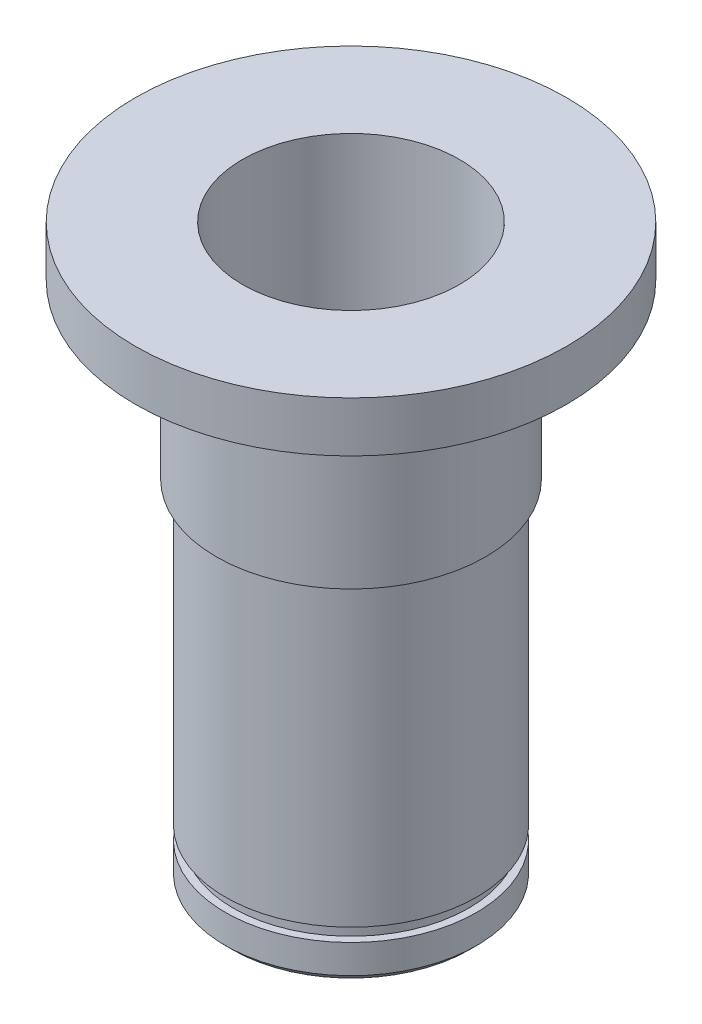
ISO-10303-21;
HEADER;
FILE_DESCRIPTION(('STEP AP214'),'2;1');
FILE_NAME('part.step','',(''),(''),'','','');
FILE_SCHEMA(('AUTOMOTIVE_DESIGN { 1 0 10303 214 1 1 1 1 }'));
ENDSEC;
DATA;
#1=APPLICATION_CONTEXT('core data for automotive mechanical design processes');
#2=APPLICATION_PROTOCOL_DEFINITION('international standard','automotive_design',2000,#1);
#3=PRODUCT_CONTEXT('',#1,'mechanical');
#4=PRODUCT('Part','Part','',(#3));
#5=PRODUCT_RELATED_PRODUCT_CATEGORY('part','',(#4));
#6=PRODUCT_DEFINITION_FORMATION('','',#4);
#7=PRODUCT_DEFINITION_CONTEXT('part definition',#1,'design');
#8=PRODUCT_DEFINITION('design','',#6,#7);
#9=PRODUCT_DEFINITION_SHAPE('','',#8);
#10=(LENGTH_UNIT() NAMED_UNIT(*) SI_UNIT(.MILLI.,.METRE.));
#11=(NAMED_UNIT(*) PLANE_ANGLE_UNIT() SI_UNIT($,.RADIAN.));
#12=(NAMED_UNIT(*) SI_UNIT($,.STERADIAN.) SOLID_ANGLE_UNIT());
#13=UNCERTAINTY_MEASURE_WITH_UNIT(LENGTH_MEASURE(1.E-05),#10,'distance_accuracy_value','');
#14=(GEOMETRIC_REPRESENTATION_CONTEXT(3) GLOBAL_UNCERTAINTY_ASSIGNED_CONTEXT((#13)) GLOBAL_UNIT_ASSIGNED_CONTEXT((#10,
#11,#12)) REPRESENTATION_CONTEXT('',''));
#15=CARTESIAN_POINT('',(0.,0.,0.));
#16=DIRECTION('',(0.,0.,1.));
#17=DIRECTION('',(1.,0.,0.));
#18=AXIS2_PLACEMENT_3D('',#15,#16,#17);
#19=CARTESIAN_POINT('',(0.,18.2827823293179,0.));
#20=DIRECTION('',(0.,1.,0.));
#21=DIRECTION('',(0.,0.,1.));
#22=AXIS2_PLACEMENT_3D('',#19,#20,#21);
#23=CYLINDRICAL_SURFACE('',#22,11.0998);
#24=CARTESIAN_POINT('',(0.,30.400625,0.));
#25=DIRECTION('',(0.,-1.,0.));
#26=DIRECTION('',(0.,0.,-1.));
#27=AXIS2_PLACEMENT_3D('',#24,#25,#26);
#28=CIRCLE('',#27,11.0998);
#29=CARTESIAN_POINT('',(0.,30.400625,-11.0998));
#30=VERTEX_POINT('',#29);
#31=EDGE_CURVE('E55',#30,#30,#28,.T.);
#32=ORIENTED_EDGE('',*,*,#31,.T.);
#33=EDGE_LOOP('',(#32));
#34=FACE_BOUND('',#33,.T.);
#35=CARTESIAN_POINT('',(0.,4.3434,0.));
#36=DIRECTION('',(0.,-1.,0.));
#37=DIRECTION('',(0.,0.,-1.));
#38=AXIS2_PLACEMENT_3D('',#35,#36,#37);
#39=CIRCLE('',#38,11.0998);
#40=CARTESIAN_POINT('',(0.,4.3434,-11.0998));
#41=VERTEX_POINT('',#40);
#42=EDGE_CURVE('E85',#41,#41,#39,.T.);
#43=ORIENTED_EDGE('',*,*,#42,.F.);
#44=EDGE_LOOP('',(#43));
#45=FACE_BOUND('',#44,.T.);
#46=ADVANCED_FACE('F44',(#34,#45),#23,.T.);
#47=CARTESIAN_POINT('',(0.,0.634999999999997,0.));
#48=DIRECTION('',(0.,-1.,0.));
#49=DIRECTION('',(0.,0.,-1.));
#50=AXIS2_PLACEMENT_3D('',#47,#48,#49);
#51=CIRCLE('',#50,11.0998);
#52=CARTESIAN_POINT('',(0.,0.634999999999997,-11.0998));
#53=VERTEX_POINT('',#52);
#54=EDGE_CURVE('E67',#53,#53,#51,.F.);
#55=ORIENTED_EDGE('',*,*,#54,.T.);
#56=EDGE_LOOP('',(#55));
#57=FACE_BOUND('',#56,.T.);
#58=CARTESIAN_POINT('',(0.,3.175,0.));
#59=DIRECTION('',(0.,-1.,0.));
#60=DIRECTION('',(0.,0.,-1.));
#61=AXIS2_PLACEMENT_3D('',#58,#59,#60);
#62=CIRCLE('',#61,11.0998);
#63=CARTESIAN_POINT('',(0.,3.175,-11.0998));
#64=VERTEX_POINT('',#63);
#65=EDGE_CURVE('E94',#64,#64,#62,.T.);
#66=ORIENTED_EDGE('',*,*,#65,.T.);
#67=EDGE_LOOP('',(#66));
#68=FACE_BOUND('',#67,.T.);
#69=ADVANCED_FACE('F98',(#57,#68),#23,.T.);
#70=CARTESIAN_POINT('',(0.,18.2827823293179,0.));
#71=DIRECTION('',(0.,1.,0.));
#72=DIRECTION('',(0.,0.,1.));
#73=AXIS2_PLACEMENT_3D('',#70,#71,#72);
#74=CYLINDRICAL_SURFACE('',#73,11.8999);
#75=CARTESIAN_POINT('',(0.,45.640625,0.));
#76=DIRECTION('',(0.,-1.,0.));
#77=DIRECTION('',(0.,0.,-1.));
#78=AXIS2_PLACEMENT_3D('',#75,#76,#77);
#79=CIRCLE('',#78,11.8999);
#80=CARTESIAN_POINT('',(0.,45.640625,-11.8999));
#81=VERTEX_POINT('',#80);
#82=EDGE_CURVE('E12',#81,#81,#79,.T.);
#83=ORIENTED_EDGE('',*,*,#82,.T.);
#84=EDGE_LOOP('',(#83));
#85=FACE_BOUND('',#84,.T.);
#86=CARTESIAN_POINT('',(0.,30.7975,0.));
#87=DIRECTION('',(0.,1.,0.));
#88=DIRECTION('',(0.,0.,1.));
#89=AXIS2_PLACEMENT_3D('',#86,#87,#88);
#90=CIRCLE('',#89,11.8999);
#91=CARTESIAN_POINT('',(0.,30.7975,11.8999));
#92=VERTEX_POINT('',#91);
#93=EDGE_CURVE('E70',#92,#92,#90,.T.);
#94=ORIENTED_EDGE('',*,*,#93,.T.);
#95=EDGE_LOOP('',(#94));
#96=FACE_BOUND('',#95,.T.);
#97=ADVANCED_FACE('F120',(#85,#96),#74,.T.);
#98=CARTESIAN_POINT('',(-11.8999,30.7975,0.));
#99=DIRECTION('',(0.,-1.,0.));
#100=DIRECTION('',(0.,0.,-1.));
#101=AXIS2_PLACEMENT_3D('',#98,#99,#100);
#102=PLANE('',#101);
#103=CARTESIAN_POINT('',(0.,30.7975,0.));
#104=DIRECTION('',(0.,-1.,0.));
#105=DIRECTION('',(0.,0.,-1.));
#106=AXIS2_PLACEMENT_3D('',#103,#104,#105);
#107=CIRCLE('',#106,11.496675);
#108=CARTESIAN_POINT('',(0.,30.7975,-11.496675));
#109=VERTEX_POINT('',#108);
#110=EDGE_CURVE('E59',#109,#109,#107,.F.);
#111=ORIENTED_EDGE('',*,*,#110,.T.);
#112=EDGE_LOOP('',(#111));
#113=FACE_BOUND('',#112,.T.);
#114=ORIENTED_EDGE('',*,*,#93,.F.);
#115=EDGE_LOOP('',(#114));
#116=FACE_BOUND('',#115,.T.);
#117=ADVANCED_FACE('F127',(#113,#116),#102,.T.);
#118=CARTESIAN_POINT('',(-11.0998,0.,0.));
#119=DIRECTION('',(0.,-1.,0.));
#120=DIRECTION('',(0.,0.,-1.));
#121=AXIS2_PLACEMENT_3D('',#118,#119,#120);
#122=PLANE('',#121);
#123=CARTESIAN_POINT('',(0.,0.,0.));
#124=DIRECTION('',(0.,-1.,0.));
#125=DIRECTION('',(0.,0.,-1.));
#126=AXIS2_PLACEMENT_3D('',#123,#124,#125);
#127=CIRCLE('',#126,10.4648);
#128=CARTESIAN_POINT('',(0.,0.,-10.4648));
#129=VERTEX_POINT('',#128);
#130=EDGE_CURVE('E64',#129,#129,#127,.T.);
#131=ORIENTED_EDGE('',*,*,#130,.T.);
#132=EDGE_LOOP('',(#131));
#133=FACE_BOUND('',#132,.T.);
#134=CARTESIAN_POINT('',(0.,0.,0.));
#135=DIRECTION('',(0.,1.,0.));
#136=DIRECTION('',(0.,0.,1.));
#137=AXIS2_PLACEMENT_3D('',#134,#135,#136);
#138=CIRCLE('',#137,9.5885);
#139=CARTESIAN_POINT('',(0.,0.,9.5885));
#140=VERTEX_POINT('',#139);
#141=EDGE_CURVE('E73',#140,#140,#138,.T.);
#142=ORIENTED_EDGE('',*,*,#141,.T.);
#143=EDGE_LOOP('',(#142));
#144=FACE_BOUND('',#143,.T.);
#145=ADVANCED_FACE('F125',(#133,#144),#122,.T.);
#146=CARTESIAN_POINT('',(0.,18.2827823293179,0.));
#147=DIRECTION('',(0.,1.,0.));
#148=DIRECTION('',(0.,0.,1.));
#149=AXIS2_PLACEMENT_3D('',#146,#147,#148);
#150=CYLINDRICAL_SURFACE('',#149,9.5885);
#151=CARTESIAN_POINT('',(0.,50.4825,0.));
#152=DIRECTION('',(0.,1.,0.));
#153=DIRECTION('',(0.,0.,1.));
#154=AXIS2_PLACEMENT_3D('',#151,#152,#153);
#155=CIRCLE('',#154,9.5885);
#156=CARTESIAN_POINT('',(0.,50.4825,9.5885));
#157=VERTEX_POINT('',#156);
#158=EDGE_CURVE('E76',#157,#157,#155,.T.);
#159=ORIENTED_EDGE('',*,*,#158,.T.);
#160=EDGE_LOOP('',(#159));
#161=FACE_BOUND('',#160,.T.);
#162=ORIENTED_EDGE('',*,*,#141,.F.);
#163=EDGE_LOOP('',(#162));
#164=FACE_BOUND('',#163,.T.);
#165=ADVANCED_FACE('F151',(#161,#164),#150,.F.);
#166=CARTESIAN_POINT('',(-9.5885,50.4825,0.));
#167=DIRECTION('',(0.,1.,0.));
#168=DIRECTION('',(0.,0.,1.));
#169=AXIS2_PLACEMENT_3D('',#166,#167,#168);
#170=PLANE('',#169);
#171=CARTESIAN_POINT('',(0.,50.4825,0.));
#172=DIRECTION('',(0.,1.,0.));
#173=DIRECTION('',(0.,0.,1.));
#174=AXIS2_PLACEMENT_3D('',#171,#172,#173);
#175=CIRCLE('',#174,19.05);
#176=CARTESIAN_POINT('',(0.,50.4825,19.05));
#177=VERTEX_POINT('',#176);
#178=EDGE_CURVE('E79',#177,#177,#175,.T.);
#179=ORIENTED_EDGE('',*,*,#178,.T.);
#180=EDGE_LOOP('',(#179));
#181=FACE_BOUND('',#180,.T.);
#182=ORIENTED_EDGE('',*,*,#158,.F.);
#183=EDGE_LOOP('',(#182));
#184=FACE_BOUND('',#183,.T.);
#185=ADVANCED_FACE('F155',(#181,#184),#170,.T.);
#186=CARTESIAN_POINT('',(0.,18.2827823293179,0.));
#187=DIRECTION('',(0.,1.,0.));
#188=DIRECTION('',(0.,0.,1.));
#189=AXIS2_PLACEMENT_3D('',#186,#187,#188);
#190=CYLINDRICAL_SURFACE('',#189,19.05);
#191=CARTESIAN_POINT('',(0.,46.0375,0.));
#192=DIRECTION('',(0.,1.,0.));
#193=DIRECTION('',(0.,0.,1.));
#194=AXIS2_PLACEMENT_3D('',#191,#192,#193);
#195=CIRCLE('',#194,19.05);
#196=CARTESIAN_POINT('',(0.,46.0375,19.05));
#197=VERTEX_POINT('',#196);
#198=EDGE_CURVE('E82',#197,#197,#195,.T.);
#199=ORIENTED_EDGE('',*,*,#198,.T.);
#200=EDGE_LOOP('',(#199));
#201=FACE_BOUND('',#200,.T.);
#202=ORIENTED_EDGE('',*,*,#178,.F.);
#203=EDGE_LOOP('',(#202));
#204=FACE_BOUND('',#203,.T.);
#205=ADVANCED_FACE('F143',(#201,#204),#190,.T.);
#206=CARTESIAN_POINT('',(-19.05,46.0375,0.));
#207=DIRECTION('',(0.,-1.,0.));
#208=DIRECTION('',(0.,0.,-1.));
#209=AXIS2_PLACEMENT_3D('',#206,#207,#208);
#210=PLANE('',#209);
#211=CARTESIAN_POINT('',(0.,46.0375,0.));
#212=DIRECTION('',(0.,-1.,0.));
#213=DIRECTION('',(0.,0.,-1.));
#214=AXIS2_PLACEMENT_3D('',#211,#212,#213);
#215=CIRCLE('',#214,12.296775);
#216=CARTESIAN_POINT('',(0.,46.0375,-12.296775));
#217=VERTEX_POINT('',#216);
#218=EDGE_CURVE('E51',#217,#217,#215,.F.);
#219=ORIENTED_EDGE('',*,*,#218,.T.);
#220=EDGE_LOOP('',(#219));
#221=FACE_BOUND('',#220,.T.);
#222=ORIENTED_EDGE('',*,*,#198,.F.);
#223=EDGE_LOOP('',(#222));
#224=FACE_BOUND('',#223,.T.);
#225=ADVANCED_FACE('F135',(#221,#224),#210,.T.);
#226=CARTESIAN_POINT('',(0.,0.634999999999997,0.));
#227=DIRECTION('',(0.,1.,0.));
#228=DIRECTION('',(0.,0.,1.));
#229=AXIS2_PLACEMENT_3D('',#226,#227,#228);
#230=CONICAL_SURFACE('',#229,11.0998,0.785398163397452);
#231=ORIENTED_EDGE('',*,*,#130,.F.);
#232=EDGE_LOOP('',(#231));
#233=FACE_BOUND('',#232,.T.);
#234=ORIENTED_EDGE('',*,*,#54,.F.);
#235=EDGE_LOOP('',(#234));
#236=FACE_BOUND('',#235,.T.);
#237=ADVANCED_FACE('F133',(#233,#236),#230,.T.);
#238=CARTESIAN_POINT('',(-11.0998,4.3434,0.));
#239=DIRECTION('',(0.,-1.,0.));
#240=DIRECTION('',(0.,0.,-1.));
#241=AXIS2_PLACEMENT_3D('',#238,#239,#240);
#242=PLANE('',#241);
#243=ORIENTED_EDGE('',*,*,#42,.T.);
#244=EDGE_LOOP('',(#243));
#245=FACE_BOUND('',#244,.T.);
#246=CARTESIAN_POINT('',(0.,4.3434,0.));
#247=DIRECTION('',(0.,-1.,0.));
#248=DIRECTION('',(0.,0.,-1.));
#249=AXIS2_PLACEMENT_3D('',#246,#247,#248);
#250=CIRCLE('',#249,10.4267);
#251=CARTESIAN_POINT('',(0.,4.3434,-10.4267));
#252=VERTEX_POINT('',#251);
#253=EDGE_CURVE('E88',#252,#252,#250,.T.);
#254=ORIENTED_EDGE('',*,*,#253,.F.);
#255=EDGE_LOOP('',(#254));
#256=FACE_BOUND('',#255,.T.);
#257=ADVANCED_FACE('F111',(#245,#256),#242,.T.);
#258=CARTESIAN_POINT('',(0.,-2.07005721397897,0.));
#259=DIRECTION('',(0.,-1.,0.));
#260=DIRECTION('',(0.,0.,-1.));
#261=AXIS2_PLACEMENT_3D('',#258,#259,#260);
#262=CYLINDRICAL_SURFACE('',#261,10.4267);
#263=ORIENTED_EDGE('',*,*,#253,.T.);
#264=EDGE_LOOP('',(#263));
#265=FACE_BOUND('',#264,.T.);
#266=CARTESIAN_POINT('',(0.,3.175,0.));
#267=DIRECTION('',(0.,-1.,0.));
#268=DIRECTION('',(0.,0.,-1.));
#269=AXIS2_PLACEMENT_3D('',#266,#267,#268);
#270=CIRCLE('',#269,10.4267);
#271=CARTESIAN_POINT('',(0.,3.175,-10.4267));
#272=VERTEX_POINT('',#271);
#273=EDGE_CURVE('E91',#272,#272,#270,.T.);
#274=ORIENTED_EDGE('',*,*,#273,.F.);
#275=EDGE_LOOP('',(#274));
#276=FACE_BOUND('',#275,.T.);
#277=ADVANCED_FACE('F103',(#265,#276),#262,.T.);
#278=CARTESIAN_POINT('',(-11.0998,3.175,0.));
#279=DIRECTION('',(0.,1.,0.));
#280=DIRECTION('',(0.,0.,1.));
#281=AXIS2_PLACEMENT_3D('',#278,#279,#280);
#282=PLANE('',#281);
#283=ORIENTED_EDGE('',*,*,#273,.T.);
#284=EDGE_LOOP('',(#283));
#285=FACE_BOUND('',#284,.T.);
#286=ORIENTED_EDGE('',*,*,#65,.F.);
#287=EDGE_LOOP('',(#286));
#288=FACE_BOUND('',#287,.T.);
#289=ADVANCED_FACE('F100',(#285,#288),#282,.T.);
#290=CARTESIAN_POINT('',(0.,30.400625,0.));
#291=DIRECTION('',(0.,-1.,0.));
#292=DIRECTION('',(0.,0.,-1.));
#293=AXIS2_PLACEMENT_3D('',#290,#291,#292);
#294=TOROIDAL_SURFACE('',#293,11.496675,0.396875);
#295=ORIENTED_EDGE('',*,*,#31,.F.);
#296=EDGE_LOOP('',(#295));
#297=FACE_BOUND('',#296,.T.);
#298=ORIENTED_EDGE('',*,*,#110,.F.);
#299=EDGE_LOOP('',(#298));
#300=FACE_BOUND('',#299,.T.);
#301=ADVANCED_FACE('F102',(#297,#300),#294,.F.);
#302=CARTESIAN_POINT('',(0.,45.640625,0.));
#303=DIRECTION('',(0.,-1.,0.));
#304=DIRECTION('',(0.,0.,-1.));
#305=AXIS2_PLACEMENT_3D('',#302,#303,#304);
#306=TOROIDAL_SURFACE('',#305,12.296775,0.396875);
#307=ORIENTED_EDGE('',*,*,#82,.F.);
#308=EDGE_LOOP('',(#307));
#309=FACE_BOUND('',#308,.T.);
#310=ORIENTED_EDGE('',*,*,#218,.F.);
#311=EDGE_LOOP('',(#310));
#312=FACE_BOUND('',#311,.T.);
#313=ADVANCED_FACE('F46',(#309,#312),#306,.F.);
#314=CLOSED_SHELL('',(#46,#69,#97,#117,#145,#165,#185,#205,#225,#237,#257,#277,#289,#301,#313));
#315=MANIFOLD_SOLID_BREP('B2',#314);
#316=ADVANCED_BREP_SHAPE_REPRESENTATION('',(#18,#315),#14);
#317=SHAPE_DEFINITION_REPRESENTATION(#9,#316);
ENDSEC;
END-ISO-10303-21;
